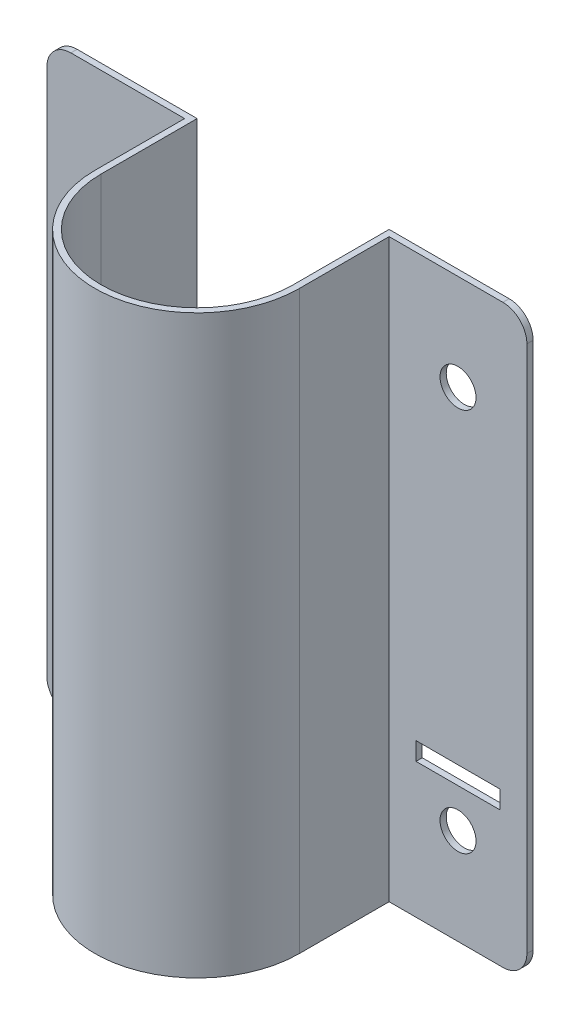
ISO-10303-21;
HEADER;
FILE_DESCRIPTION(('STEP AP214'),'2;1');
FILE_NAME('part.step','',(''),(''),'','','');
FILE_SCHEMA(('AUTOMOTIVE_DESIGN { 1 0 10303 214 1 1 1 1 }'));
ENDSEC;
DATA;
#1=APPLICATION_CONTEXT('core data for automotive mechanical design processes');
#2=APPLICATION_PROTOCOL_DEFINITION('international standard','automotive_design',2000,#1);
#3=PRODUCT_CONTEXT('',#1,'mechanical');
#4=PRODUCT('Part','Part','',(#3));
#5=PRODUCT_RELATED_PRODUCT_CATEGORY('part','',(#4));
#6=PRODUCT_DEFINITION_FORMATION('','',#4);
#7=PRODUCT_DEFINITION_CONTEXT('part definition',#1,'design');
#8=PRODUCT_DEFINITION('design','',#6,#7);
#9=PRODUCT_DEFINITION_SHAPE('','',#8);
#10=(LENGTH_UNIT() NAMED_UNIT(*) SI_UNIT(.MILLI.,.METRE.));
#11=(NAMED_UNIT(*) PLANE_ANGLE_UNIT() SI_UNIT($,.RADIAN.));
#12=(NAMED_UNIT(*) SI_UNIT($,.STERADIAN.) SOLID_ANGLE_UNIT());
#13=UNCERTAINTY_MEASURE_WITH_UNIT(LENGTH_MEASURE(1.E-05),#10,'distance_accuracy_value','');
#14=(GEOMETRIC_REPRESENTATION_CONTEXT(3) GLOBAL_UNCERTAINTY_ASSIGNED_CONTEXT((#13)) GLOBAL_UNIT_ASSIGNED_CONTEXT((#10,
#11,#12)) REPRESENTATION_CONTEXT('',''));
#15=CARTESIAN_POINT('',(0.,0.,0.));
#16=DIRECTION('',(0.,0.,1.));
#17=DIRECTION('',(1.,0.,0.));
#18=AXIS2_PLACEMENT_3D('',#15,#16,#17);
#19=CARTESIAN_POINT('',(0.,-152.4,0.));
#20=DIRECTION('',(0.,1.,0.));
#21=DIRECTION('',(0.,0.,1.));
#22=AXIS2_PLACEMENT_3D('',#19,#20,#21);
#23=CYLINDRICAL_SURFACE('',#22,25.4);
#24=CARTESIAN_POINT('',(0.,0.,0.));
#25=DIRECTION('',(0.,-1.,0.));
#26=DIRECTION('',(0.,0.,1.));
#27=AXIS2_PLACEMENT_3D('',#24,#25,#26);
#28=CIRCLE('',#27,25.4);
#29=CARTESIAN_POINT('',(25.4,0.,0.));
#30=VERTEX_POINT('',#29);
#31=CARTESIAN_POINT('',(-25.4,0.,0.));
#32=VERTEX_POINT('',#31);
#33=EDGE_CURVE('E318',#30,#32,#28,.T.);
#34=ORIENTED_EDGE('',*,*,#33,.F.);
#35=DIRECTION('',(0.,1.,0.));
#36=VECTOR('',#35,1.);
#37=CARTESIAN_POINT('',(25.4,-152.4,0.));
#38=LINE('',#37,#36);
#39=CARTESIAN_POINT('',(25.4,-152.4,0.));
#40=VERTEX_POINT('',#39);
#41=EDGE_CURVE('E395',#40,#30,#38,.T.);
#42=ORIENTED_EDGE('',*,*,#41,.F.);
#43=CARTESIAN_POINT('',(0.,-152.4,0.));
#44=DIRECTION('',(0.,-1.,0.));
#45=DIRECTION('',(0.,0.,1.));
#46=AXIS2_PLACEMENT_3D('',#43,#44,#45);
#47=CIRCLE('',#46,25.4);
#48=CARTESIAN_POINT('',(-25.4,-152.4,0.));
#49=VERTEX_POINT('',#48);
#50=EDGE_CURVE('E319',#40,#49,#47,.T.);
#51=ORIENTED_EDGE('',*,*,#50,.T.);
#52=DIRECTION('',(0.,1.,0.));
#53=VECTOR('',#52,1.);
#54=CARTESIAN_POINT('',(-25.4,-152.4,0.));
#55=LINE('',#54,#53);
#56=EDGE_CURVE('E358',#49,#32,#55,.T.);
#57=ORIENTED_EDGE('',*,*,#56,.T.);
#58=EDGE_LOOP('',(#34,#42,#51,#57));
#59=FACE_BOUND('',#58,.T.);
#60=ADVANCED_FACE('F39',(#59),#23,.F.);
#61=CARTESIAN_POINT('',(25.4,-152.4,0.));
#62=DIRECTION('',(-1.,0.,0.));
#63=DIRECTION('',(0.,0.,1.));
#64=AXIS2_PLACEMENT_3D('',#61,#62,#63);
#65=PLANE('',#64);
#66=DIRECTION('',(0.,0.,1.));
#67=VECTOR('',#66,1.);
#68=CARTESIAN_POINT('',(25.4,0.,0.));
#69=LINE('',#68,#67);
#70=CARTESIAN_POINT('',(25.4,0.,-25.4));
#71=VERTEX_POINT('',#70);
#72=EDGE_CURVE('E324',#71,#30,#69,.T.);
#73=ORIENTED_EDGE('',*,*,#72,.F.);
#74=DIRECTION('',(0.,1.,0.));
#75=VECTOR('',#74,1.);
#76=CARTESIAN_POINT('',(25.4,-152.4,-25.4));
#77=LINE('',#76,#75);
#78=CARTESIAN_POINT('',(25.4,-152.4,-25.4));
#79=VERTEX_POINT('',#78);
#80=EDGE_CURVE('E399',#79,#71,#77,.T.);
#81=ORIENTED_EDGE('',*,*,#80,.F.);
#82=DIRECTION('',(0.,0.,1.));
#83=VECTOR('',#82,1.);
#84=CARTESIAN_POINT('',(25.4,-152.4,0.));
#85=LINE('',#84,#83);
#86=EDGE_CURVE('E354',#79,#40,#85,.T.);
#87=ORIENTED_EDGE('',*,*,#86,.T.);
#88=ORIENTED_EDGE('',*,*,#41,.T.);
#89=EDGE_LOOP('',(#73,#81,#87,#88));
#90=FACE_BOUND('',#89,.T.);
#91=ADVANCED_FACE('F532',(#90),#65,.T.);
#92=CARTESIAN_POINT('',(25.4,-152.4,-25.4));
#93=DIRECTION('',(0.,0.,-1.));
#94=DIRECTION('',(-1.,0.,0.));
#95=AXIS2_PLACEMENT_3D('',#92,#93,#94);
#96=PLANE('',#95);
#97=DIRECTION('',(0.,-1.,0.));
#98=VECTOR('',#97,1.);
#99=CARTESIAN_POINT('',(34.163,-116.68125,-25.4));
#100=LINE('',#99,#98);
#101=CARTESIAN_POINT('',(34.163,-111.91875,-25.4));
#102=VERTEX_POINT('',#101);
#103=CARTESIAN_POINT('',(34.163,-116.68125,-25.4));
#104=VERTEX_POINT('',#103);
#105=EDGE_CURVE('E202',#102,#104,#100,.T.);
#106=ORIENTED_EDGE('',*,*,#105,.T.);
#107=DIRECTION('',(1.,0.,0.));
#108=VECTOR('',#107,1.);
#109=CARTESIAN_POINT('',(56.388,-116.68125,-25.4));
#110=LINE('',#109,#108);
#111=CARTESIAN_POINT('',(56.388,-116.68125,-25.4));
#112=VERTEX_POINT('',#111);
#113=EDGE_CURVE('E212',#104,#112,#110,.T.);
#114=ORIENTED_EDGE('',*,*,#113,.T.);
#115=DIRECTION('',(0.,1.,0.));
#116=VECTOR('',#115,1.);
#117=CARTESIAN_POINT('',(56.388,-116.68125,-25.4));
#118=LINE('',#117,#116);
#119=CARTESIAN_POINT('',(56.388,-111.91875,-25.4));
#120=VERTEX_POINT('',#119);
#121=EDGE_CURVE('E55',#112,#120,#118,.T.);
#122=ORIENTED_EDGE('',*,*,#121,.T.);
#123=DIRECTION('',(-1.,0.,0.));
#124=VECTOR('',#123,1.);
#125=CARTESIAN_POINT('',(56.388,-111.91875,-25.4));
#126=LINE('',#125,#124);
#127=EDGE_CURVE('E209',#120,#102,#126,.T.);
#128=ORIENTED_EDGE('',*,*,#127,.T.);
#129=EDGE_LOOP('',(#106,#114,#122,#128));
#130=FACE_BOUND('',#129,.T.);
#131=CARTESIAN_POINT('',(45.2755,-25.4,-25.4));
#132=DIRECTION('',(0.,0.,-1.));
#133=DIRECTION('',(-1.,0.,0.));
#134=AXIS2_PLACEMENT_3D('',#131,#132,#133);
#135=CIRCLE('',#134,4.76249999999999);
#136=CARTESIAN_POINT('',(40.513,-25.4,-25.4));
#137=VERTEX_POINT('',#136);
#138=EDGE_CURVE('E313',#137,#137,#135,.T.);
#139=ORIENTED_EDGE('',*,*,#138,.F.);
#140=EDGE_LOOP('',(#139));
#141=FACE_BOUND('',#140,.T.);
#142=CARTESIAN_POINT('',(45.2755,-127.,-25.4));
#143=DIRECTION('',(0.,0.,-1.));
#144=DIRECTION('',(-1.,0.,0.));
#145=AXIS2_PLACEMENT_3D('',#142,#143,#144);
#146=CIRCLE('',#145,4.76250000000002);
#147=CARTESIAN_POINT('',(40.513,-127.,-25.4));
#148=VERTEX_POINT('',#147);
#149=EDGE_CURVE('E309',#148,#148,#146,.T.);
#150=ORIENTED_EDGE('',*,*,#149,.F.);
#151=EDGE_LOOP('',(#150));
#152=FACE_BOUND('',#151,.T.);
#153=DIRECTION('',(-1.,0.,0.));
#154=VECTOR('',#153,1.);
#155=CARTESIAN_POINT('',(25.4,0.,-25.4));
#156=LINE('',#155,#154);
#157=CARTESIAN_POINT('',(57.15,0.,-25.4));
#158=VERTEX_POINT('',#157);
#159=EDGE_CURVE('E389',#158,#71,#156,.T.);
#160=ORIENTED_EDGE('',*,*,#159,.F.);
#161=CARTESIAN_POINT('',(57.15,-6.35,-25.4));
#162=DIRECTION('',(0.,0.,-1.));
#163=DIRECTION('',(-1.,0.,0.));
#164=AXIS2_PLACEMENT_3D('',#161,#162,#163);
#165=CIRCLE('',#164,6.35);
#166=CARTESIAN_POINT('',(63.5,-6.35000000000005,-25.4));
#167=VERTEX_POINT('',#166);
#168=EDGE_CURVE('E453',#158,#167,#165,.T.);
#169=ORIENTED_EDGE('',*,*,#168,.T.);
#170=DIRECTION('',(0.,1.,0.));
#171=VECTOR('',#170,1.);
#172=CARTESIAN_POINT('',(63.5,-152.4,-25.4));
#173=LINE('',#172,#171);
#174=CARTESIAN_POINT('',(63.5,-146.05,-25.4));
#175=VERTEX_POINT('',#174);
#176=EDGE_CURVE('E403',#175,#167,#173,.T.);
#177=ORIENTED_EDGE('',*,*,#176,.F.);
#178=CARTESIAN_POINT('',(57.15,-146.05,-25.4));
#179=DIRECTION('',(0.,0.,-1.));
#180=DIRECTION('',(-1.,0.,0.));
#181=AXIS2_PLACEMENT_3D('',#178,#179,#180);
#182=CIRCLE('',#181,6.35);
#183=CARTESIAN_POINT('',(57.15,-152.4,-25.4));
#184=VERTEX_POINT('',#183);
#185=EDGE_CURVE('E450',#175,#184,#182,.T.);
#186=ORIENTED_EDGE('',*,*,#185,.T.);
#187=DIRECTION('',(-1.,0.,0.));
#188=VECTOR('',#187,1.);
#189=CARTESIAN_POINT('',(25.4,-152.4,-25.4));
#190=LINE('',#189,#188);
#191=EDGE_CURVE('E351',#184,#79,#190,.T.);
#192=ORIENTED_EDGE('',*,*,#191,.T.);
#193=ORIENTED_EDGE('',*,*,#80,.T.);
#194=EDGE_LOOP('',(#160,#169,#177,#186,#192,#193));
#195=FACE_BOUND('',#194,.T.);
#196=ADVANCED_FACE('F217',(#130,#141,#152,#195),#96,.T.);
#197=CARTESIAN_POINT('',(63.5,-152.4,-25.4));
#198=DIRECTION('',(1.,0.,0.));
#199=DIRECTION('',(0.,0.,-1.));
#200=AXIS2_PLACEMENT_3D('',#197,#198,#199);
#201=PLANE('',#200);
#202=ORIENTED_EDGE('',*,*,#176,.T.);
#203=DIRECTION('',(0.,0.,-1.));
#204=VECTOR('',#203,1.);
#205=CARTESIAN_POINT('',(63.5,-6.34999999999999,-25.4));
#206=LINE('',#205,#204);
#207=CARTESIAN_POINT('',(63.5,-6.35000000000005,-23.749));
#208=VERTEX_POINT('',#207);
#209=EDGE_CURVE('E460',#167,#208,#206,.F.);
#210=ORIENTED_EDGE('',*,*,#209,.T.);
#211=DIRECTION('',(0.,1.,0.));
#212=VECTOR('',#211,1.);
#213=CARTESIAN_POINT('',(63.5,-152.4,-23.749));
#214=LINE('',#213,#212);
#215=CARTESIAN_POINT('',(63.5,-146.05,-23.749));
#216=VERTEX_POINT('',#215);
#217=EDGE_CURVE('E407',#216,#208,#214,.T.);
#218=ORIENTED_EDGE('',*,*,#217,.F.);
#219=DIRECTION('',(0.,0.,-1.));
#220=VECTOR('',#219,1.);
#221=CARTESIAN_POINT('',(63.5,-146.05,-25.4));
#222=LINE('',#221,#220);
#223=EDGE_CURVE('E456',#216,#175,#222,.T.);
#224=ORIENTED_EDGE('',*,*,#223,.T.);
#225=EDGE_LOOP('',(#202,#210,#218,#224));
#226=FACE_BOUND('',#225,.T.);
#227=ADVANCED_FACE('F546',(#226),#201,.T.);
#228=CARTESIAN_POINT('',(27.051,-152.4,-23.749));
#229=DIRECTION('',(0.,0.,1.));
#230=DIRECTION('',(1.,0.,0.));
#231=AXIS2_PLACEMENT_3D('',#228,#229,#230);
#232=PLANE('',#231);
#233=DIRECTION('',(0.,-1.,0.));
#234=VECTOR('',#233,1.);
#235=CARTESIAN_POINT('',(34.163,-116.68125,-23.749));
#236=LINE('',#235,#234);
#237=CARTESIAN_POINT('',(34.163,-111.91875,-23.749));
#238=VERTEX_POINT('',#237);
#239=CARTESIAN_POINT('',(34.163,-116.68125,-23.749));
#240=VERTEX_POINT('',#239);
#241=EDGE_CURVE('E63',#238,#240,#236,.T.);
#242=ORIENTED_EDGE('',*,*,#241,.F.);
#243=DIRECTION('',(-1.,0.,0.));
#244=VECTOR('',#243,1.);
#245=CARTESIAN_POINT('',(56.388,-111.91875,-23.749));
#246=LINE('',#245,#244);
#247=CARTESIAN_POINT('',(56.388,-111.91875,-23.749));
#248=VERTEX_POINT('',#247);
#249=EDGE_CURVE('E221',#248,#238,#246,.T.);
#250=ORIENTED_EDGE('',*,*,#249,.F.);
#251=DIRECTION('',(0.,1.,0.));
#252=VECTOR('',#251,1.);
#253=CARTESIAN_POINT('',(56.388,-116.68125,-23.749));
#254=LINE('',#253,#252);
#255=CARTESIAN_POINT('',(56.388,-116.68125,-23.749));
#256=VERTEX_POINT('',#255);
#257=EDGE_CURVE('E225',#256,#248,#254,.T.);
#258=ORIENTED_EDGE('',*,*,#257,.F.);
#259=DIRECTION('',(1.,0.,0.));
#260=VECTOR('',#259,1.);
#261=CARTESIAN_POINT('',(56.388,-116.68125,-23.749));
#262=LINE('',#261,#260);
#263=EDGE_CURVE('E234',#240,#256,#262,.T.);
#264=ORIENTED_EDGE('',*,*,#263,.F.);
#265=EDGE_LOOP('',(#242,#250,#258,#264));
#266=FACE_BOUND('',#265,.T.);
#267=CARTESIAN_POINT('',(45.2755,-25.4,-23.749));
#268=DIRECTION('',(0.,0.,1.));
#269=DIRECTION('',(-1.,0.,0.));
#270=AXIS2_PLACEMENT_3D('',#267,#268,#269);
#271=CIRCLE('',#270,4.76249999999999);
#272=CARTESIAN_POINT('',(40.513,-25.4,-23.749));
#273=VERTEX_POINT('',#272);
#274=EDGE_CURVE('E297',#273,#273,#271,.T.);
#275=ORIENTED_EDGE('',*,*,#274,.F.);
#276=EDGE_LOOP('',(#275));
#277=FACE_BOUND('',#276,.T.);
#278=CARTESIAN_POINT('',(45.2755,-127.,-23.749));
#279=DIRECTION('',(0.,0.,1.));
#280=DIRECTION('',(-1.,0.,0.));
#281=AXIS2_PLACEMENT_3D('',#278,#279,#280);
#282=CIRCLE('',#281,4.76250000000002);
#283=CARTESIAN_POINT('',(40.513,-127.,-23.749));
#284=VERTEX_POINT('',#283);
#285=EDGE_CURVE('E244',#284,#284,#282,.T.);
#286=ORIENTED_EDGE('',*,*,#285,.F.);
#287=EDGE_LOOP('',(#286));
#288=FACE_BOUND('',#287,.T.);
#289=ORIENTED_EDGE('',*,*,#217,.T.);
#290=CARTESIAN_POINT('',(57.15,-6.35,-23.749));
#291=DIRECTION('',(0.,0.,1.));
#292=DIRECTION('',(1.,0.,0.));
#293=AXIS2_PLACEMENT_3D('',#290,#291,#292);
#294=CIRCLE('',#293,6.35);
#295=CARTESIAN_POINT('',(57.15,0.,-23.749));
#296=VERTEX_POINT('',#295);
#297=EDGE_CURVE('E466',#208,#296,#294,.T.);
#298=ORIENTED_EDGE('',*,*,#297,.T.);
#299=DIRECTION('',(1.,0.,0.));
#300=VECTOR('',#299,1.);
#301=CARTESIAN_POINT('',(27.051,0.,-23.749));
#302=LINE('',#301,#300);
#303=CARTESIAN_POINT('',(27.051,0.,-23.749));
#304=VERTEX_POINT('',#303);
#305=EDGE_CURVE('E385',#304,#296,#302,.T.);
#306=ORIENTED_EDGE('',*,*,#305,.F.);
#307=DIRECTION('',(0.,1.,0.));
#308=VECTOR('',#307,1.);
#309=CARTESIAN_POINT('',(27.051,-152.4,-23.749));
#310=LINE('',#309,#308);
#311=CARTESIAN_POINT('',(27.051,-152.4,-23.749));
#312=VERTEX_POINT('',#311);
#313=EDGE_CURVE('E411',#312,#304,#310,.T.);
#314=ORIENTED_EDGE('',*,*,#313,.F.);
#315=DIRECTION('',(1.,0.,0.));
#316=VECTOR('',#315,1.);
#317=CARTESIAN_POINT('',(27.051,-152.4,-23.749));
#318=LINE('',#317,#316);
#319=CARTESIAN_POINT('',(57.15,-152.4,-23.749));
#320=VERTEX_POINT('',#319);
#321=EDGE_CURVE('E347',#312,#320,#318,.T.);
#322=ORIENTED_EDGE('',*,*,#321,.T.);
#323=CARTESIAN_POINT('',(57.15,-146.05,-23.749));
#324=DIRECTION('',(0.,0.,1.));
#325=DIRECTION('',(1.,0.,0.));
#326=AXIS2_PLACEMENT_3D('',#323,#324,#325);
#327=CIRCLE('',#326,6.35);
#328=EDGE_CURVE('E463',#320,#216,#327,.T.);
#329=ORIENTED_EDGE('',*,*,#328,.T.);
#330=EDGE_LOOP('',(#289,#298,#306,#314,#322,#329));
#331=FACE_BOUND('',#330,.T.);
#332=ADVANCED_FACE('F543',(#266,#277,#288,#331),#232,.T.);
#333=CARTESIAN_POINT('',(27.051,-152.4,0.));
#334=DIRECTION('',(1.,0.,0.));
#335=DIRECTION('',(0.,0.,-1.));
#336=AXIS2_PLACEMENT_3D('',#333,#334,#335);
#337=PLANE('',#336);
#338=DIRECTION('',(0.,0.,-1.));
#339=VECTOR('',#338,1.);
#340=CARTESIAN_POINT('',(27.051,0.,0.));
#341=LINE('',#340,#339);
#342=CARTESIAN_POINT('',(27.051,0.,0.));
#343=VERTEX_POINT('',#342);
#344=EDGE_CURVE('E381',#343,#304,#341,.T.);
#345=ORIENTED_EDGE('',*,*,#344,.F.);
#346=DIRECTION('',(0.,1.,0.));
#347=VECTOR('',#346,1.);
#348=CARTESIAN_POINT('',(27.051,-152.4,0.));
#349=LINE('',#348,#347);
#350=CARTESIAN_POINT('',(27.051,-152.4,0.));
#351=VERTEX_POINT('',#350);
#352=EDGE_CURVE('E414',#351,#343,#349,.T.);
#353=ORIENTED_EDGE('',*,*,#352,.F.);
#354=DIRECTION('',(0.,0.,-1.));
#355=VECTOR('',#354,1.);
#356=CARTESIAN_POINT('',(27.051,-152.4,0.));
#357=LINE('',#356,#355);
#358=EDGE_CURVE('E343',#351,#312,#357,.T.);
#359=ORIENTED_EDGE('',*,*,#358,.T.);
#360=ORIENTED_EDGE('',*,*,#313,.T.);
#361=EDGE_LOOP('',(#345,#353,#359,#360));
#362=FACE_BOUND('',#361,.T.);
#363=ADVANCED_FACE('F556',(#362),#337,.T.);
#364=CARTESIAN_POINT('',(0.,-152.4,0.));
#365=DIRECTION('',(0.,1.,0.));
#366=DIRECTION('',(0.,0.,1.));
#367=AXIS2_PLACEMENT_3D('',#364,#365,#366);
#368=CYLINDRICAL_SURFACE('',#367,27.051);
#369=CARTESIAN_POINT('',(0.,0.,0.));
#370=DIRECTION('',(0.,1.,0.));
#371=DIRECTION('',(0.,0.,1.));
#372=AXIS2_PLACEMENT_3D('',#369,#370,#371);
#373=CIRCLE('',#372,27.051);
#374=CARTESIAN_POINT('',(-27.051,0.,0.));
#375=VERTEX_POINT('',#374);
#376=EDGE_CURVE('E377',#375,#343,#373,.T.);
#377=ORIENTED_EDGE('',*,*,#376,.F.);
#378=DIRECTION('',(0.,1.,0.));
#379=VECTOR('',#378,1.);
#380=CARTESIAN_POINT('',(-27.051,-152.4,0.));
#381=LINE('',#380,#379);
#382=CARTESIAN_POINT('',(-27.051,-152.4,0.));
#383=VERTEX_POINT('',#382);
#384=EDGE_CURVE('E417',#383,#375,#381,.T.);
#385=ORIENTED_EDGE('',*,*,#384,.F.);
#386=CARTESIAN_POINT('',(0.,-152.4,0.));
#387=DIRECTION('',(0.,1.,0.));
#388=DIRECTION('',(0.,0.,1.));
#389=AXIS2_PLACEMENT_3D('',#386,#387,#388);
#390=CIRCLE('',#389,27.051);
#391=EDGE_CURVE('E339',#383,#351,#390,.T.);
#392=ORIENTED_EDGE('',*,*,#391,.T.);
#393=ORIENTED_EDGE('',*,*,#352,.T.);
#394=EDGE_LOOP('',(#377,#385,#392,#393));
#395=FACE_BOUND('',#394,.T.);
#396=ADVANCED_FACE('F558',(#395),#368,.T.);
#397=CARTESIAN_POINT('',(-27.051,-152.4,0.));
#398=DIRECTION('',(-1.,0.,0.));
#399=DIRECTION('',(0.,0.,1.));
#400=AXIS2_PLACEMENT_3D('',#397,#398,#399);
#401=PLANE('',#400);
#402=DIRECTION('',(0.,0.,1.));
#403=VECTOR('',#402,1.);
#404=CARTESIAN_POINT('',(-27.051,0.,0.));
#405=LINE('',#404,#403);
#406=CARTESIAN_POINT('',(-27.051,0.,-23.749));
#407=VERTEX_POINT('',#406);
#408=EDGE_CURVE('E373',#407,#375,#405,.T.);
#409=ORIENTED_EDGE('',*,*,#408,.F.);
#410=DIRECTION('',(0.,1.,0.));
#411=VECTOR('',#410,1.);
#412=CARTESIAN_POINT('',(-27.051,-152.4,-23.749));
#413=LINE('',#412,#411);
#414=CARTESIAN_POINT('',(-27.051,-152.4,-23.749));
#415=VERTEX_POINT('',#414);
#416=EDGE_CURVE('E420',#415,#407,#413,.T.);
#417=ORIENTED_EDGE('',*,*,#416,.F.);
#418=DIRECTION('',(0.,0.,1.));
#419=VECTOR('',#418,1.);
#420=CARTESIAN_POINT('',(-27.051,-152.4,0.));
#421=LINE('',#420,#419);
#422=EDGE_CURVE('E335',#415,#383,#421,.T.);
#423=ORIENTED_EDGE('',*,*,#422,.T.);
#424=ORIENTED_EDGE('',*,*,#384,.T.);
#425=EDGE_LOOP('',(#409,#417,#423,#424));
#426=FACE_BOUND('',#425,.T.);
#427=ADVANCED_FACE('F514',(#426),#401,.T.);
#428=CARTESIAN_POINT('',(-27.051,-152.4,-23.749));
#429=DIRECTION('',(0.,0.,1.));
#430=DIRECTION('',(1.,0.,0.));
#431=AXIS2_PLACEMENT_3D('',#428,#429,#430);
#432=PLANE('',#431);
#433=DIRECTION('',(0.,-1.,0.));
#434=VECTOR('',#433,1.);
#435=CARTESIAN_POINT('',(-56.388,-116.68125,-23.749));
#436=LINE('',#435,#434);
#437=CARTESIAN_POINT('',(-56.388,-111.91875,-23.749));
#438=VERTEX_POINT('',#437);
#439=CARTESIAN_POINT('',(-56.388,-116.68125,-23.749));
#440=VERTEX_POINT('',#439);
#441=EDGE_CURVE('E268',#438,#440,#436,.T.);
#442=ORIENTED_EDGE('',*,*,#441,.F.);
#443=DIRECTION('',(-1.,0.,0.));
#444=VECTOR('',#443,1.);
#445=CARTESIAN_POINT('',(-56.388,-111.91875,-23.749));
#446=LINE('',#445,#444);
#447=CARTESIAN_POINT('',(-34.163,-111.91875,-23.749));
#448=VERTEX_POINT('',#447);
#449=EDGE_CURVE('E255',#448,#438,#446,.T.);
#450=ORIENTED_EDGE('',*,*,#449,.F.);
#451=DIRECTION('',(0.,1.,0.));
#452=VECTOR('',#451,1.);
#453=CARTESIAN_POINT('',(-34.163,-116.68125,-23.749));
#454=LINE('',#453,#452);
#455=CARTESIAN_POINT('',(-34.163,-116.68125,-23.749));
#456=VERTEX_POINT('',#455);
#457=EDGE_CURVE('E275',#456,#448,#454,.T.);
#458=ORIENTED_EDGE('',*,*,#457,.F.);
#459=DIRECTION('',(1.,0.,0.));
#460=VECTOR('',#459,1.);
#461=CARTESIAN_POINT('',(-56.388,-116.68125,-23.749));
#462=LINE('',#461,#460);
#463=EDGE_CURVE('E271',#440,#456,#462,.T.);
#464=ORIENTED_EDGE('',*,*,#463,.F.);
#465=EDGE_LOOP('',(#442,#450,#458,#464));
#466=FACE_BOUND('',#465,.T.);
#467=CARTESIAN_POINT('',(-45.2755,-127.,-23.749));
#468=DIRECTION('',(0.,0.,1.));
#469=DIRECTION('',(1.,0.,0.));
#470=AXIS2_PLACEMENT_3D('',#467,#468,#469);
#471=CIRCLE('',#470,4.7625);
#472=CARTESIAN_POINT('',(-40.513,-127.,-23.749));
#473=VERTEX_POINT('',#472);
#474=EDGE_CURVE('E296',#473,#473,#471,.T.);
#475=ORIENTED_EDGE('',*,*,#474,.F.);
#476=EDGE_LOOP('',(#475));
#477=FACE_BOUND('',#476,.T.);
#478=CARTESIAN_POINT('',(-45.2755,-25.4,-23.749));
#479=DIRECTION('',(0.,0.,1.));
#480=DIRECTION('',(1.,0.,0.));
#481=AXIS2_PLACEMENT_3D('',#478,#479,#480);
#482=CIRCLE('',#481,4.7625);
#483=CARTESIAN_POINT('',(-40.513,-25.4,-23.749));
#484=VERTEX_POINT('',#483);
#485=EDGE_CURVE('E301',#484,#484,#482,.T.);
#486=ORIENTED_EDGE('',*,*,#485,.F.);
#487=EDGE_LOOP('',(#486));
#488=FACE_BOUND('',#487,.T.);
#489=DIRECTION('',(1.,0.,0.));
#490=VECTOR('',#489,1.);
#491=CARTESIAN_POINT('',(-27.051,0.,-23.749));
#492=LINE('',#491,#490);
#493=CARTESIAN_POINT('',(-57.15,0.,-23.749));
#494=VERTEX_POINT('',#493);
#495=EDGE_CURVE('E370',#494,#407,#492,.T.);
#496=ORIENTED_EDGE('',*,*,#495,.F.);
#497=CARTESIAN_POINT('',(-57.15,-6.35,-23.749));
#498=DIRECTION('',(0.,0.,1.));
#499=DIRECTION('',(1.,0.,0.));
#500=AXIS2_PLACEMENT_3D('',#497,#498,#499);
#501=CIRCLE('',#500,6.35);
#502=CARTESIAN_POINT('',(-63.5,-6.35000000000005,-23.749));
#503=VERTEX_POINT('',#502);
#504=EDGE_CURVE('E478',#494,#503,#501,.T.);
#505=ORIENTED_EDGE('',*,*,#504,.T.);
#506=DIRECTION('',(0.,1.,0.));
#507=VECTOR('',#506,1.);
#508=CARTESIAN_POINT('',(-63.5,-152.4,-23.749));
#509=LINE('',#508,#507);
#510=CARTESIAN_POINT('',(-63.5,-146.05,-23.749));
#511=VERTEX_POINT('',#510);
#512=EDGE_CURVE('E424',#511,#503,#509,.T.);
#513=ORIENTED_EDGE('',*,*,#512,.F.);
#514=CARTESIAN_POINT('',(-57.15,-146.05,-23.749));
#515=DIRECTION('',(0.,0.,1.));
#516=DIRECTION('',(1.,0.,0.));
#517=AXIS2_PLACEMENT_3D('',#514,#515,#516);
#518=CIRCLE('',#517,6.35);
#519=CARTESIAN_POINT('',(-57.15,-152.4,-23.749));
#520=VERTEX_POINT('',#519);
#521=EDGE_CURVE('E475',#511,#520,#518,.T.);
#522=ORIENTED_EDGE('',*,*,#521,.T.);
#523=DIRECTION('',(1.,0.,0.));
#524=VECTOR('',#523,1.);
#525=CARTESIAN_POINT('',(-27.051,-152.4,-23.749));
#526=LINE('',#525,#524);
#527=EDGE_CURVE('E332',#520,#415,#526,.T.);
#528=ORIENTED_EDGE('',*,*,#527,.T.);
#529=ORIENTED_EDGE('',*,*,#416,.T.);
#530=EDGE_LOOP('',(#496,#505,#513,#522,#528,#529));
#531=FACE_BOUND('',#530,.T.);
#532=ADVANCED_FACE('F504',(#466,#477,#488,#531),#432,.T.);
#533=CARTESIAN_POINT('',(-63.5,-152.4,-25.4));
#534=DIRECTION('',(-1.,0.,0.));
#535=DIRECTION('',(0.,0.,1.));
#536=AXIS2_PLACEMENT_3D('',#533,#534,#535);
#537=PLANE('',#536);
#538=ORIENTED_EDGE('',*,*,#512,.T.);
#539=DIRECTION('',(0.,0.,1.));
#540=VECTOR('',#539,1.);
#541=CARTESIAN_POINT('',(-63.5,-6.34999999999999,-25.4));
#542=LINE('',#541,#540);
#543=CARTESIAN_POINT('',(-63.5,-6.35000000000005,-25.4));
#544=VERTEX_POINT('',#543);
#545=EDGE_CURVE('E485',#503,#544,#542,.F.);
#546=ORIENTED_EDGE('',*,*,#545,.T.);
#547=DIRECTION('',(0.,1.,0.));
#548=VECTOR('',#547,1.);
#549=CARTESIAN_POINT('',(-63.5,-152.4,-25.4));
#550=LINE('',#549,#548);
#551=CARTESIAN_POINT('',(-63.5,-146.05,-25.4));
#552=VERTEX_POINT('',#551);
#553=EDGE_CURVE('E428',#552,#544,#550,.T.);
#554=ORIENTED_EDGE('',*,*,#553,.F.);
#555=DIRECTION('',(0.,0.,1.));
#556=VECTOR('',#555,1.);
#557=CARTESIAN_POINT('',(-63.5,-146.05,-23.749));
#558=LINE('',#557,#556);
#559=EDGE_CURVE('E481',#552,#511,#558,.T.);
#560=ORIENTED_EDGE('',*,*,#559,.T.);
#561=EDGE_LOOP('',(#538,#546,#554,#560));
#562=FACE_BOUND('',#561,.T.);
#563=ADVANCED_FACE('F498',(#562),#537,.T.);
#564=CARTESIAN_POINT('',(-25.4,-152.4,-25.4));
#565=DIRECTION('',(0.,0.,-1.));
#566=DIRECTION('',(-1.,0.,0.));
#567=AXIS2_PLACEMENT_3D('',#564,#565,#566);
#568=PLANE('',#567);
#569=DIRECTION('',(0.,-1.,0.));
#570=VECTOR('',#569,1.);
#571=CARTESIAN_POINT('',(-56.388,-116.68125,-25.4));
#572=LINE('',#571,#570);
#573=CARTESIAN_POINT('',(-56.388,-111.91875,-25.4));
#574=VERTEX_POINT('',#573);
#575=CARTESIAN_POINT('',(-56.388,-116.68125,-25.4));
#576=VERTEX_POINT('',#575);
#577=EDGE_CURVE('E250',#574,#576,#572,.T.);
#578=ORIENTED_EDGE('',*,*,#577,.T.);
#579=DIRECTION('',(1.,0.,0.));
#580=VECTOR('',#579,1.);
#581=CARTESIAN_POINT('',(-56.388,-116.68125,-25.4));
#582=LINE('',#581,#580);
#583=CARTESIAN_POINT('',(-34.163,-116.68125,-25.4));
#584=VERTEX_POINT('',#583);
#585=EDGE_CURVE('E254',#576,#584,#582,.T.);
#586=ORIENTED_EDGE('',*,*,#585,.T.);
#587=DIRECTION('',(0.,1.,0.));
#588=VECTOR('',#587,1.);
#589=CARTESIAN_POINT('',(-34.163,-116.68125,-25.4));
#590=LINE('',#589,#588);
#591=CARTESIAN_POINT('',(-34.163,-111.91875,-25.4));
#592=VERTEX_POINT('',#591);
#593=EDGE_CURVE('E259',#584,#592,#590,.T.);
#594=ORIENTED_EDGE('',*,*,#593,.T.);
#595=DIRECTION('',(-1.,0.,0.));
#596=VECTOR('',#595,1.);
#597=CARTESIAN_POINT('',(-56.388,-111.91875,-25.4));
#598=LINE('',#597,#596);
#599=EDGE_CURVE('E263',#592,#574,#598,.T.);
#600=ORIENTED_EDGE('',*,*,#599,.T.);
#601=EDGE_LOOP('',(#578,#586,#594,#600));
#602=FACE_BOUND('',#601,.T.);
#603=CARTESIAN_POINT('',(-45.2755,-127.,-25.4));
#604=DIRECTION('',(0.,0.,-1.));
#605=DIRECTION('',(-1.,0.,0.));
#606=AXIS2_PLACEMENT_3D('',#603,#604,#605);
#607=CIRCLE('',#606,4.7625);
#608=CARTESIAN_POINT('',(-50.038,-127.,-25.4));
#609=VERTEX_POINT('',#608);
#610=EDGE_CURVE('E314',#609,#609,#607,.T.);
#611=ORIENTED_EDGE('',*,*,#610,.F.);
#612=EDGE_LOOP('',(#611));
#613=FACE_BOUND('',#612,.T.);
#614=CARTESIAN_POINT('',(-45.2755,-25.4,-25.4));
#615=DIRECTION('',(0.,0.,-1.));
#616=DIRECTION('',(-1.,0.,0.));
#617=AXIS2_PLACEMENT_3D('',#614,#615,#616);
#618=CIRCLE('',#617,4.7625);
#619=CARTESIAN_POINT('',(-50.038,-25.4,-25.4));
#620=VERTEX_POINT('',#619);
#621=EDGE_CURVE('E308',#620,#620,#618,.T.);
#622=ORIENTED_EDGE('',*,*,#621,.F.);
#623=EDGE_LOOP('',(#622));
#624=FACE_BOUND('',#623,.T.);
#625=ORIENTED_EDGE('',*,*,#553,.T.);
#626=CARTESIAN_POINT('',(-57.15,-6.35,-25.4));
#627=DIRECTION('',(0.,0.,-1.));
#628=DIRECTION('',(-1.,0.,0.));
#629=AXIS2_PLACEMENT_3D('',#626,#627,#628);
#630=CIRCLE('',#629,6.35);
#631=CARTESIAN_POINT('',(-57.15,0.,-25.4));
#632=VERTEX_POINT('',#631);
#633=EDGE_CURVE('E11',#544,#632,#630,.T.);
#634=ORIENTED_EDGE('',*,*,#633,.T.);
#635=DIRECTION('',(-1.,0.,0.));
#636=VECTOR('',#635,1.);
#637=CARTESIAN_POINT('',(-25.4,0.,-25.4));
#638=LINE('',#637,#636);
#639=CARTESIAN_POINT('',(-25.4,0.,-25.4));
#640=VERTEX_POINT('',#639);
#641=EDGE_CURVE('E366',#640,#632,#638,.T.);
#642=ORIENTED_EDGE('',*,*,#641,.F.);
#643=DIRECTION('',(0.,1.,0.));
#644=VECTOR('',#643,1.);
#645=CARTESIAN_POINT('',(-25.4,-152.4,-25.4));
#646=LINE('',#645,#644);
#647=CARTESIAN_POINT('',(-25.4,-152.4,-25.4));
#648=VERTEX_POINT('',#647);
#649=EDGE_CURVE('E432',#648,#640,#646,.T.);
#650=ORIENTED_EDGE('',*,*,#649,.F.);
#651=DIRECTION('',(-1.,0.,0.));
#652=VECTOR('',#651,1.);
#653=CARTESIAN_POINT('',(-25.4,-152.4,-25.4));
#654=LINE('',#653,#652);
#655=CARTESIAN_POINT('',(-57.15,-152.4,-25.4));
#656=VERTEX_POINT('',#655);
#657=EDGE_CURVE('E328',#648,#656,#654,.T.);
#658=ORIENTED_EDGE('',*,*,#657,.T.);
#659=CARTESIAN_POINT('',(-57.15,-146.05,-25.4));
#660=DIRECTION('',(0.,0.,-1.));
#661=DIRECTION('',(-1.,0.,0.));
#662=AXIS2_PLACEMENT_3D('',#659,#660,#661);
#663=CIRCLE('',#662,6.35);
#664=EDGE_CURVE('E48',#656,#552,#663,.T.);
#665=ORIENTED_EDGE('',*,*,#664,.T.);
#666=EDGE_LOOP('',(#625,#634,#642,#650,#658,#665));
#667=FACE_BOUND('',#666,.T.);
#668=ADVANCED_FACE('F491',(#602,#613,#624,#667),#568,.T.);
#669=CARTESIAN_POINT('',(-25.4,-152.4,0.));
#670=DIRECTION('',(1.,0.,0.));
#671=DIRECTION('',(0.,0.,-1.));
#672=AXIS2_PLACEMENT_3D('',#669,#670,#671);
#673=PLANE('',#672);
#674=DIRECTION('',(0.,0.,-1.));
#675=VECTOR('',#674,1.);
#676=CARTESIAN_POINT('',(-25.4,0.,0.));
#677=LINE('',#676,#675);
#678=EDGE_CURVE('E362',#32,#640,#677,.T.);
#679=ORIENTED_EDGE('',*,*,#678,.F.);
#680=ORIENTED_EDGE('',*,*,#56,.F.);
#681=DIRECTION('',(0.,0.,-1.));
#682=VECTOR('',#681,1.);
#683=CARTESIAN_POINT('',(-25.4,-152.4,0.));
#684=LINE('',#683,#682);
#685=EDGE_CURVE('E323',#49,#648,#684,.T.);
#686=ORIENTED_EDGE('',*,*,#685,.T.);
#687=ORIENTED_EDGE('',*,*,#649,.T.);
#688=EDGE_LOOP('',(#679,#680,#686,#687));
#689=FACE_BOUND('',#688,.T.);
#690=ADVANCED_FACE('F525',(#689),#673,.T.);
#691=CARTESIAN_POINT('',(0.,-152.4,0.));
#692=DIRECTION('',(0.,1.,0.));
#693=DIRECTION('',(0.,0.,1.));
#694=AXIS2_PLACEMENT_3D('',#691,#692,#693);
#695=PLANE('',#694);
#696=ORIENTED_EDGE('',*,*,#191,.F.);
#697=DIRECTION('',(0.,0.,-1.));
#698=VECTOR('',#697,1.);
#699=CARTESIAN_POINT('',(57.15,-152.4,-23.749));
#700=LINE('',#699,#698);
#701=EDGE_CURVE('E472',#184,#320,#700,.F.);
#702=ORIENTED_EDGE('',*,*,#701,.T.);
#703=ORIENTED_EDGE('',*,*,#321,.F.);
#704=ORIENTED_EDGE('',*,*,#358,.F.);
#705=ORIENTED_EDGE('',*,*,#391,.F.);
#706=ORIENTED_EDGE('',*,*,#422,.F.);
#707=ORIENTED_EDGE('',*,*,#527,.F.);
#708=DIRECTION('',(0.,0.,1.));
#709=VECTOR('',#708,1.);
#710=CARTESIAN_POINT('',(-57.15,-152.4,-25.4));
#711=LINE('',#710,#709);
#712=EDGE_CURVE('E469',#520,#656,#711,.F.);
#713=ORIENTED_EDGE('',*,*,#712,.T.);
#714=ORIENTED_EDGE('',*,*,#657,.F.);
#715=ORIENTED_EDGE('',*,*,#685,.F.);
#716=ORIENTED_EDGE('',*,*,#50,.F.);
#717=ORIENTED_EDGE('',*,*,#86,.F.);
#718=EDGE_LOOP('',(#696,#702,#703,#704,#705,#706,#707,#713,#714,#715,#716,#717));
#719=FACE_BOUND('',#718,.T.);
#720=ADVANCED_FACE('F509',(#719),#695,.F.);
#721=CARTESIAN_POINT('',(0.,0.,0.));
#722=DIRECTION('',(0.,1.,0.));
#723=DIRECTION('',(0.,0.,1.));
#724=AXIS2_PLACEMENT_3D('',#721,#722,#723);
#725=PLANE('',#724);
#726=ORIENTED_EDGE('',*,*,#305,.T.);
#727=DIRECTION('',(0.,0.,-1.));
#728=VECTOR('',#727,1.);
#729=CARTESIAN_POINT('',(57.15,0.,0.));
#730=LINE('',#729,#728);
#731=EDGE_CURVE('E446',#296,#158,#730,.T.);
#732=ORIENTED_EDGE('',*,*,#731,.T.);
#733=ORIENTED_EDGE('',*,*,#159,.T.);
#734=ORIENTED_EDGE('',*,*,#72,.T.);
#735=ORIENTED_EDGE('',*,*,#33,.T.);
#736=ORIENTED_EDGE('',*,*,#678,.T.);
#737=ORIENTED_EDGE('',*,*,#641,.T.);
#738=DIRECTION('',(0.,0.,1.));
#739=VECTOR('',#738,1.);
#740=CARTESIAN_POINT('',(-57.15,0.,0.));
#741=LINE('',#740,#739);
#742=EDGE_CURVE('E398',#632,#494,#741,.T.);
#743=ORIENTED_EDGE('',*,*,#742,.T.);
#744=ORIENTED_EDGE('',*,*,#495,.T.);
#745=ORIENTED_EDGE('',*,*,#408,.T.);
#746=ORIENTED_EDGE('',*,*,#376,.T.);
#747=ORIENTED_EDGE('',*,*,#344,.T.);
#748=EDGE_LOOP('',(#726,#732,#733,#734,#735,#736,#737,#743,#744,#745,#746,#747));
#749=FACE_BOUND('',#748,.T.);
#750=ADVANCED_FACE('F517',(#749),#725,.T.);
#751=CARTESIAN_POINT('',(-45.2755,-25.4,-74.549));
#752=DIRECTION('',(0.,0.,1.));
#753=DIRECTION('',(1.,0.,0.));
#754=AXIS2_PLACEMENT_3D('',#751,#752,#753);
#755=CYLINDRICAL_SURFACE('',#754,4.7625);
#756=ORIENTED_EDGE('',*,*,#621,.T.);
#757=EDGE_LOOP('',(#756));
#758=FACE_BOUND('',#757,.T.);
#759=ORIENTED_EDGE('',*,*,#485,.T.);
#760=EDGE_LOOP('',(#759));
#761=FACE_BOUND('',#760,.T.);
#762=ADVANCED_FACE('F611',(#758,#761),#755,.F.);
#763=CARTESIAN_POINT('',(-45.2755,-127.,-74.549));
#764=DIRECTION('',(0.,0.,1.));
#765=DIRECTION('',(1.,0.,0.));
#766=AXIS2_PLACEMENT_3D('',#763,#764,#765);
#767=CYLINDRICAL_SURFACE('',#766,4.7625);
#768=ORIENTED_EDGE('',*,*,#610,.T.);
#769=EDGE_LOOP('',(#768));
#770=FACE_BOUND('',#769,.T.);
#771=ORIENTED_EDGE('',*,*,#474,.T.);
#772=EDGE_LOOP('',(#771));
#773=FACE_BOUND('',#772,.T.);
#774=ADVANCED_FACE('F604',(#770,#773),#767,.F.);
#775=CARTESIAN_POINT('',(45.2755,-127.,-74.549));
#776=DIRECTION('',(0.,0.,1.));
#777=DIRECTION('',(1.,0.,0.));
#778=AXIS2_PLACEMENT_3D('',#775,#776,#777);
#779=CYLINDRICAL_SURFACE('',#778,4.76250000000002);
#780=ORIENTED_EDGE('',*,*,#149,.T.);
#781=EDGE_LOOP('',(#780));
#782=FACE_BOUND('',#781,.T.);
#783=ORIENTED_EDGE('',*,*,#285,.T.);
#784=EDGE_LOOP('',(#783));
#785=FACE_BOUND('',#784,.T.);
#786=ADVANCED_FACE('F601',(#782,#785),#779,.F.);
#787=CARTESIAN_POINT('',(45.2755,-25.4,-74.549));
#788=DIRECTION('',(0.,0.,1.));
#789=DIRECTION('',(1.,0.,0.));
#790=AXIS2_PLACEMENT_3D('',#787,#788,#789);
#791=CYLINDRICAL_SURFACE('',#790,4.76249999999999);
#792=ORIENTED_EDGE('',*,*,#138,.T.);
#793=EDGE_LOOP('',(#792));
#794=FACE_BOUND('',#793,.T.);
#795=ORIENTED_EDGE('',*,*,#274,.T.);
#796=EDGE_LOOP('',(#795));
#797=FACE_BOUND('',#796,.T.);
#798=ADVANCED_FACE('F578',(#794,#797),#791,.F.);
#799=CARTESIAN_POINT('',(57.15,-6.35,0.));
#800=DIRECTION('',(0.,0.,-1.));
#801=DIRECTION('',(-1.,0.,0.));
#802=AXIS2_PLACEMENT_3D('',#799,#800,#801);
#803=CYLINDRICAL_SURFACE('',#802,6.35);
#804=ORIENTED_EDGE('',*,*,#297,.F.);
#805=ORIENTED_EDGE('',*,*,#209,.F.);
#806=ORIENTED_EDGE('',*,*,#168,.F.);
#807=ORIENTED_EDGE('',*,*,#731,.F.);
#808=EDGE_LOOP('',(#804,#805,#806,#807));
#809=FACE_BOUND('',#808,.T.);
#810=ADVANCED_FACE('F550',(#809),#803,.T.);
#811=CARTESIAN_POINT('',(57.15,-146.05,-25.4));
#812=DIRECTION('',(0.,0.,1.));
#813=DIRECTION('',(1.,0.,0.));
#814=AXIS2_PLACEMENT_3D('',#811,#812,#813);
#815=CYLINDRICAL_SURFACE('',#814,6.35);
#816=ORIENTED_EDGE('',*,*,#328,.F.);
#817=ORIENTED_EDGE('',*,*,#701,.F.);
#818=ORIENTED_EDGE('',*,*,#185,.F.);
#819=ORIENTED_EDGE('',*,*,#223,.F.);
#820=EDGE_LOOP('',(#816,#817,#818,#819));
#821=FACE_BOUND('',#820,.T.);
#822=ADVANCED_FACE('F539',(#821),#815,.T.);
#823=CARTESIAN_POINT('',(-57.15,-6.35,0.));
#824=DIRECTION('',(0.,0.,1.));
#825=DIRECTION('',(1.,0.,0.));
#826=AXIS2_PLACEMENT_3D('',#823,#824,#825);
#827=CYLINDRICAL_SURFACE('',#826,6.35);
#828=ORIENTED_EDGE('',*,*,#633,.F.);
#829=ORIENTED_EDGE('',*,*,#545,.F.);
#830=ORIENTED_EDGE('',*,*,#504,.F.);
#831=ORIENTED_EDGE('',*,*,#742,.F.);
#832=EDGE_LOOP('',(#828,#829,#830,#831));
#833=FACE_BOUND('',#832,.T.);
#834=ADVANCED_FACE('F521',(#833),#827,.T.);
#835=CARTESIAN_POINT('',(-57.15,-146.05,-25.4));
#836=DIRECTION('',(0.,0.,-1.));
#837=DIRECTION('',(-1.,0.,0.));
#838=AXIS2_PLACEMENT_3D('',#835,#836,#837);
#839=CYLINDRICAL_SURFACE('',#838,6.35);
#840=ORIENTED_EDGE('',*,*,#664,.F.);
#841=ORIENTED_EDGE('',*,*,#712,.F.);
#842=ORIENTED_EDGE('',*,*,#521,.F.);
#843=ORIENTED_EDGE('',*,*,#559,.F.);
#844=EDGE_LOOP('',(#840,#841,#842,#843));
#845=FACE_BOUND('',#844,.T.);
#846=ADVANCED_FACE('F41',(#845),#839,.T.);
#847=CARTESIAN_POINT('',(-56.388,-116.68125,-25.4));
#848=DIRECTION('',(-1.,0.,0.));
#849=DIRECTION('',(0.,0.,1.));
#850=AXIS2_PLACEMENT_3D('',#847,#848,#849);
#851=PLANE('',#850);
#852=ORIENTED_EDGE('',*,*,#441,.T.);
#853=DIRECTION('',(0.,0.,1.));
#854=VECTOR('',#853,1.);
#855=CARTESIAN_POINT('',(-56.388,-116.68125,-25.4));
#856=LINE('',#855,#854);
#857=EDGE_CURVE('E267',#576,#440,#856,.T.);
#858=ORIENTED_EDGE('',*,*,#857,.F.);
#859=ORIENTED_EDGE('',*,*,#577,.F.);
#860=DIRECTION('',(0.,0.,1.));
#861=VECTOR('',#860,1.);
#862=CARTESIAN_POINT('',(-56.388,-111.91875,-25.4));
#863=LINE('',#862,#861);
#864=EDGE_CURVE('E235',#574,#438,#863,.T.);
#865=ORIENTED_EDGE('',*,*,#864,.T.);
#866=EDGE_LOOP('',(#852,#858,#859,#865));
#867=FACE_BOUND('',#866,.T.);
#868=ADVANCED_FACE('F584',(#867),#851,.F.);
#869=CARTESIAN_POINT('',(-56.388,-111.91875,-25.4));
#870=DIRECTION('',(0.,1.,0.));
#871=DIRECTION('',(0.,0.,1.));
#872=AXIS2_PLACEMENT_3D('',#869,#870,#871);
#873=PLANE('',#872);
#874=ORIENTED_EDGE('',*,*,#449,.T.);
#875=ORIENTED_EDGE('',*,*,#864,.F.);
#876=ORIENTED_EDGE('',*,*,#599,.F.);
#877=DIRECTION('',(0.,0.,1.));
#878=VECTOR('',#877,1.);
#879=CARTESIAN_POINT('',(-34.163,-111.91875,-25.4));
#880=LINE('',#879,#878);
#881=EDGE_CURVE('E284',#592,#448,#880,.T.);
#882=ORIENTED_EDGE('',*,*,#881,.T.);
#883=EDGE_LOOP('',(#874,#875,#876,#882));
#884=FACE_BOUND('',#883,.T.);
#885=ADVANCED_FACE('F588',(#884),#873,.F.);
#886=CARTESIAN_POINT('',(-34.163,-116.68125,-25.4));
#887=DIRECTION('',(1.,0.,0.));
#888=DIRECTION('',(0.,0.,-1.));
#889=AXIS2_PLACEMENT_3D('',#886,#887,#888);
#890=PLANE('',#889);
#891=ORIENTED_EDGE('',*,*,#457,.T.);
#892=ORIENTED_EDGE('',*,*,#881,.F.);
#893=ORIENTED_EDGE('',*,*,#593,.F.);
#894=DIRECTION('',(0.,0.,1.));
#895=VECTOR('',#894,1.);
#896=CARTESIAN_POINT('',(-34.163,-116.68125,-25.4));
#897=LINE('',#896,#895);
#898=EDGE_CURVE('E287',#584,#456,#897,.T.);
#899=ORIENTED_EDGE('',*,*,#898,.T.);
#900=EDGE_LOOP('',(#891,#892,#893,#899));
#901=FACE_BOUND('',#900,.T.);
#902=ADVANCED_FACE('F594',(#901),#890,.F.);
#903=CARTESIAN_POINT('',(-56.388,-116.68125,-25.4));
#904=DIRECTION('',(0.,-1.,0.));
#905=DIRECTION('',(0.,0.,-1.));
#906=AXIS2_PLACEMENT_3D('',#903,#904,#905);
#907=PLANE('',#906);
#908=ORIENTED_EDGE('',*,*,#463,.T.);
#909=ORIENTED_EDGE('',*,*,#898,.F.);
#910=ORIENTED_EDGE('',*,*,#585,.F.);
#911=ORIENTED_EDGE('',*,*,#857,.T.);
#912=EDGE_LOOP('',(#908,#909,#910,#911));
#913=FACE_BOUND('',#912,.T.);
#914=ADVANCED_FACE('F599',(#913),#907,.F.);
#915=CARTESIAN_POINT('',(34.163,-116.68125,-25.4));
#916=DIRECTION('',(-1.,0.,0.));
#917=DIRECTION('',(0.,0.,1.));
#918=AXIS2_PLACEMENT_3D('',#915,#916,#917);
#919=PLANE('',#918);
#920=ORIENTED_EDGE('',*,*,#241,.T.);
#921=DIRECTION('',(0.,0.,1.));
#922=VECTOR('',#921,1.);
#923=CARTESIAN_POINT('',(34.163,-116.68125,-25.4));
#924=LINE('',#923,#922);
#925=EDGE_CURVE('E198',#104,#240,#924,.T.);
#926=ORIENTED_EDGE('',*,*,#925,.F.);
#927=ORIENTED_EDGE('',*,*,#105,.F.);
#928=DIRECTION('',(0.,0.,1.));
#929=VECTOR('',#928,1.);
#930=CARTESIAN_POINT('',(34.163,-111.91875,-25.4));
#931=LINE('',#930,#929);
#932=EDGE_CURVE('E241',#102,#238,#931,.T.);
#933=ORIENTED_EDGE('',*,*,#932,.T.);
#934=EDGE_LOOP('',(#920,#926,#927,#933));
#935=FACE_BOUND('',#934,.T.);
#936=ADVANCED_FACE('F200',(#935),#919,.F.);
#937=CARTESIAN_POINT('',(56.388,-111.91875,-25.4));
#938=DIRECTION('',(0.,1.,0.));
#939=DIRECTION('',(0.,0.,1.));
#940=AXIS2_PLACEMENT_3D('',#937,#938,#939);
#941=PLANE('',#940);
#942=ORIENTED_EDGE('',*,*,#249,.T.);
#943=ORIENTED_EDGE('',*,*,#932,.F.);
#944=ORIENTED_EDGE('',*,*,#127,.F.);
#945=DIRECTION('',(0.,0.,1.));
#946=VECTOR('',#945,1.);
#947=CARTESIAN_POINT('',(56.388,-111.91875,-25.4));
#948=LINE('',#947,#946);
#949=EDGE_CURVE('E245',#120,#248,#948,.T.);
#950=ORIENTED_EDGE('',*,*,#949,.T.);
#951=EDGE_LOOP('',(#942,#943,#944,#950));
#952=FACE_BOUND('',#951,.T.);
#953=ADVANCED_FACE('F638',(#952),#941,.F.);
#954=CARTESIAN_POINT('',(56.388,-116.68125,-25.4));
#955=DIRECTION('',(1.,0.,0.));
#956=DIRECTION('',(0.,0.,-1.));
#957=AXIS2_PLACEMENT_3D('',#954,#955,#956);
#958=PLANE('',#957);
#959=ORIENTED_EDGE('',*,*,#257,.T.);
#960=ORIENTED_EDGE('',*,*,#949,.F.);
#961=ORIENTED_EDGE('',*,*,#121,.F.);
#962=DIRECTION('',(0.,0.,1.));
#963=VECTOR('',#962,1.);
#964=CARTESIAN_POINT('',(56.388,-116.68125,-25.4));
#965=LINE('',#964,#963);
#966=EDGE_CURVE('E208',#112,#256,#965,.T.);
#967=ORIENTED_EDGE('',*,*,#966,.T.);
#968=EDGE_LOOP('',(#959,#960,#961,#967));
#969=FACE_BOUND('',#968,.T.);
#970=ADVANCED_FACE('F636',(#969),#958,.F.);
#971=CARTESIAN_POINT('',(56.388,-116.68125,-25.4));
#972=DIRECTION('',(0.,-1.,0.));
#973=DIRECTION('',(0.,0.,-1.));
#974=AXIS2_PLACEMENT_3D('',#971,#972,#973);
#975=PLANE('',#974);
#976=ORIENTED_EDGE('',*,*,#263,.T.);
#977=ORIENTED_EDGE('',*,*,#966,.F.);
#978=ORIENTED_EDGE('',*,*,#113,.F.);
#979=ORIENTED_EDGE('',*,*,#925,.T.);
#980=EDGE_LOOP('',(#976,#977,#978,#979));
#981=FACE_BOUND('',#980,.T.);
#982=ADVANCED_FACE('F213',(#981),#975,.F.);
#983=CLOSED_SHELL('',(#60,#91,#196,#227,#332,#363,#396,#427,#532,#563,#668,#690,#720,#750,#762,
#774,#786,#798,#810,#822,#834,#846,#868,#885,#902,#914,#936,#953,#970,#982));
#984=MANIFOLD_SOLID_BREP('B2',#983);
#985=ADVANCED_BREP_SHAPE_REPRESENTATION('',(#18,#984),#14);
#986=SHAPE_DEFINITION_REPRESENTATION(#9,#985);
ENDSEC;
END-ISO-10303-21;
